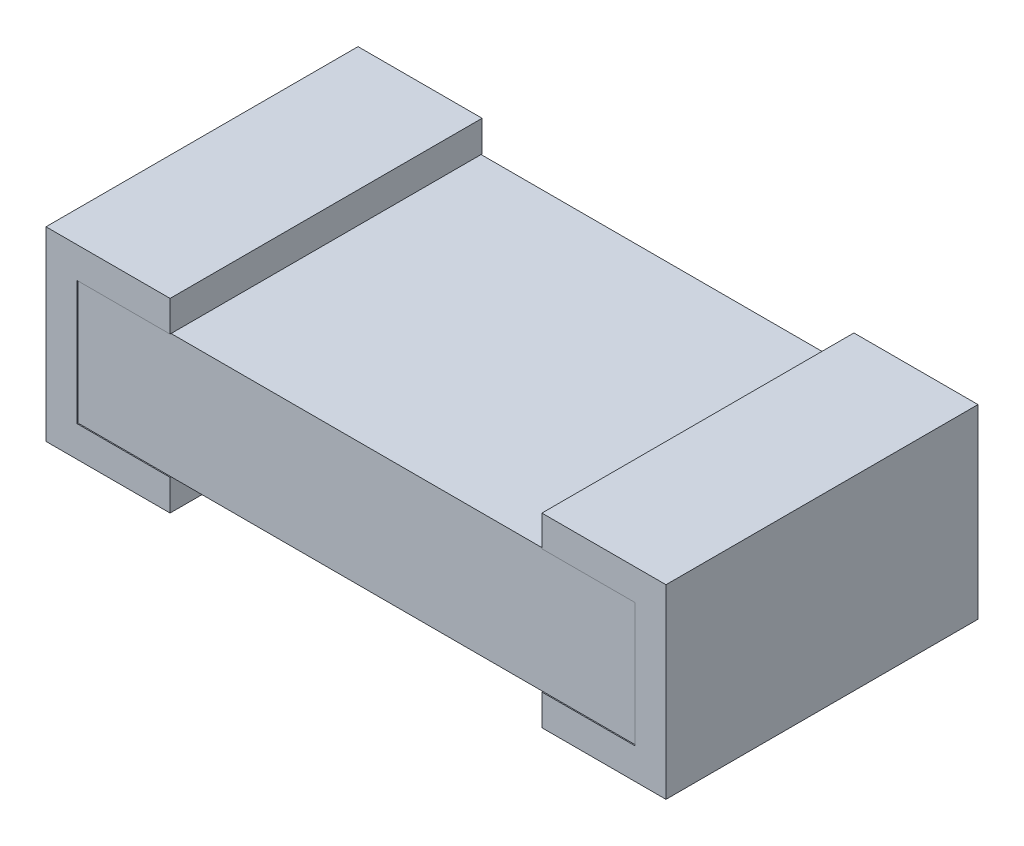
ISO-10303-21;
HEADER;
FILE_DESCRIPTION(('STEP AP214'),'2;1');
FILE_NAME('part.step','',(''),(''),'','','');
FILE_SCHEMA(('AUTOMOTIVE_DESIGN { 1 0 10303 214 1 1 1 1 }'));
ENDSEC;
DATA;
#1=APPLICATION_CONTEXT('core data for automotive mechanical design processes');
#2=APPLICATION_PROTOCOL_DEFINITION('international standard','automotive_design',2000,#1);
#3=PRODUCT_CONTEXT('',#1,'mechanical');
#4=PRODUCT('Part','Part','',(#3));
#5=PRODUCT_RELATED_PRODUCT_CATEGORY('part','',(#4));
#6=PRODUCT_DEFINITION_FORMATION('','',#4);
#7=PRODUCT_DEFINITION_CONTEXT('part definition',#1,'design');
#8=PRODUCT_DEFINITION('design','',#6,#7);
#9=PRODUCT_DEFINITION_SHAPE('','',#8);
#10=(LENGTH_UNIT() NAMED_UNIT(*) SI_UNIT(.MILLI.,.METRE.));
#11=(NAMED_UNIT(*) PLANE_ANGLE_UNIT() SI_UNIT($,.RADIAN.));
#12=(NAMED_UNIT(*) SI_UNIT($,.STERADIAN.) SOLID_ANGLE_UNIT());
#13=UNCERTAINTY_MEASURE_WITH_UNIT(LENGTH_MEASURE(1.E-05),#10,'distance_accuracy_value','');
#14=(GEOMETRIC_REPRESENTATION_CONTEXT(3) GLOBAL_UNCERTAINTY_ASSIGNED_CONTEXT((#13)) GLOBAL_UNIT_ASSIGNED_CONTEXT((#10,
#11,#12)) REPRESENTATION_CONTEXT('',''));
#15=CARTESIAN_POINT('',(0.,0.,0.));
#16=DIRECTION('',(0.,0.,1.));
#17=DIRECTION('',(1.,0.,0.));
#18=AXIS2_PLACEMENT_3D('',#15,#16,#17);
#19=CARTESIAN_POINT('',(-0.686,0.1525,0.381));
#20=DIRECTION('',(0.,-1.,0.));
#21=DIRECTION('',(0.,0.,-1.));
#22=AXIS2_PLACEMENT_3D('',#19,#20,#21);
#23=PLANE('',#22);
#24=DIRECTION('',(-1.,0.,0.));
#25=VECTOR('',#24,1.);
#26=CARTESIAN_POINT('',(-0.686,0.1525,0.381));
#27=LINE('',#26,#25);
#28=CARTESIAN_POINT('',(0.457,0.1525,0.381));
#29=VERTEX_POINT('',#28);
#30=CARTESIAN_POINT('',(-0.457,0.1525,0.381));
#31=VERTEX_POINT('',#30);
#32=EDGE_CURVE('E60',#29,#31,#27,.T.);
#33=ORIENTED_EDGE('',*,*,#32,.F.);
#34=DIRECTION('',(0.,0.,-1.));
#35=VECTOR('',#34,1.);
#36=CARTESIAN_POINT('',(0.457,0.1525,0.3835));
#37=LINE('',#36,#35);
#38=CARTESIAN_POINT('',(0.457,0.1525,-0.381));
#39=VERTEX_POINT('',#38);
#40=EDGE_CURVE('E207',#29,#39,#37,.T.);
#41=ORIENTED_EDGE('',*,*,#40,.T.);
#42=DIRECTION('',(-1.,0.,0.));
#43=VECTOR('',#42,1.);
#44=CARTESIAN_POINT('',(-0.686,0.1525,-0.381));
#45=LINE('',#44,#43);
#46=CARTESIAN_POINT('',(-0.457,0.1525,-0.381));
#47=VERTEX_POINT('',#46);
#48=EDGE_CURVE('E371',#39,#47,#45,.T.);
#49=ORIENTED_EDGE('',*,*,#48,.T.);
#50=DIRECTION('',(0.,0.,-1.));
#51=VECTOR('',#50,1.);
#52=CARTESIAN_POINT('',(-0.457,0.1525,0.3835));
#53=LINE('',#52,#51);
#54=EDGE_CURVE('E330',#31,#47,#53,.T.);
#55=ORIENTED_EDGE('',*,*,#54,.F.);
#56=EDGE_LOOP('',(#33,#41,#49,#55));
#57=FACE_BOUND('',#56,.T.);
#58=ADVANCED_FACE('F36',(#57),#23,.F.);
#59=CARTESIAN_POINT('',(-0.686,-0.1525,0.381));
#60=DIRECTION('',(0.,1.,0.));
#61=DIRECTION('',(0.,0.,1.));
#62=AXIS2_PLACEMENT_3D('',#59,#60,#61);
#63=PLANE('',#62);
#64=DIRECTION('',(1.,0.,0.));
#65=VECTOR('',#64,1.);
#66=CARTESIAN_POINT('',(-0.686,-0.1525,-0.381));
#67=LINE('',#66,#65);
#68=CARTESIAN_POINT('',(-0.457,-0.1525,-0.381));
#69=VERTEX_POINT('',#68);
#70=CARTESIAN_POINT('',(0.457,-0.1525,-0.381));
#71=VERTEX_POINT('',#70);
#72=EDGE_CURVE('E378',#69,#71,#67,.T.);
#73=ORIENTED_EDGE('',*,*,#72,.T.);
#74=DIRECTION('',(0.,0.,-1.));
#75=VECTOR('',#74,1.);
#76=CARTESIAN_POINT('',(0.457,-0.1525,0.3835));
#77=LINE('',#76,#75);
#78=CARTESIAN_POINT('',(0.457,-0.1525,0.381));
#79=VERTEX_POINT('',#78);
#80=EDGE_CURVE('E52',#79,#71,#77,.T.);
#81=ORIENTED_EDGE('',*,*,#80,.F.);
#82=DIRECTION('',(1.,0.,0.));
#83=VECTOR('',#82,1.);
#84=CARTESIAN_POINT('',(-0.686,-0.1525,0.381));
#85=LINE('',#84,#83);
#86=CARTESIAN_POINT('',(-0.457,-0.1525,0.381));
#87=VERTEX_POINT('',#86);
#88=EDGE_CURVE('E44',#87,#79,#85,.T.);
#89=ORIENTED_EDGE('',*,*,#88,.F.);
#90=DIRECTION('',(0.,0.,-1.));
#91=VECTOR('',#90,1.);
#92=CARTESIAN_POINT('',(-0.457,-0.1525,0.3835));
#93=LINE('',#92,#91);
#94=EDGE_CURVE('E343',#87,#69,#93,.T.);
#95=ORIENTED_EDGE('',*,*,#94,.T.);
#96=EDGE_LOOP('',(#73,#81,#89,#95));
#97=FACE_BOUND('',#96,.T.);
#98=ADVANCED_FACE('F394',(#97),#63,.F.);
#99=CARTESIAN_POINT('',(0.686,0.1525,0.381));
#100=DIRECTION('',(0.,0.,-1.));
#101=DIRECTION('',(-1.,0.,0.));
#102=AXIS2_PLACEMENT_3D('',#99,#100,#101);
#103=PLANE('',#102);
#104=DIRECTION('',(0.,1.,0.));
#105=VECTOR('',#104,1.);
#106=CARTESIAN_POINT('',(0.686,-0.1525,0.381));
#107=LINE('',#106,#105);
#108=CARTESIAN_POINT('',(0.686,-0.1525,0.381));
#109=VERTEX_POINT('',#108);
#110=CARTESIAN_POINT('',(0.686,0.1525,0.381));
#111=VERTEX_POINT('',#110);
#112=EDGE_CURVE('E359',#109,#111,#107,.T.);
#113=ORIENTED_EDGE('',*,*,#112,.T.);
#114=EDGE_CURVE('E361',#111,#29,#27,.T.);
#115=ORIENTED_EDGE('',*,*,#114,.T.);
#116=ORIENTED_EDGE('',*,*,#32,.T.);
#117=DIRECTION('',(1.,0.,0.));
#118=VECTOR('',#117,1.);
#119=CARTESIAN_POINT('',(0.686,0.1525,0.381));
#120=LINE('',#119,#118);
#121=CARTESIAN_POINT('',(-0.686,0.1525,0.381));
#122=VERTEX_POINT('',#121);
#123=EDGE_CURVE('E355',#122,#31,#120,.T.);
#124=ORIENTED_EDGE('',*,*,#123,.F.);
#125=DIRECTION('',(0.,-1.,0.));
#126=VECTOR('',#125,1.);
#127=CARTESIAN_POINT('',(-0.686,-0.1525,0.381));
#128=LINE('',#127,#126);
#129=CARTESIAN_POINT('',(-0.686,-0.1525,0.381));
#130=VERTEX_POINT('',#129);
#131=EDGE_CURVE('E363',#122,#130,#128,.T.);
#132=ORIENTED_EDGE('',*,*,#131,.T.);
#133=EDGE_CURVE('E11',#130,#87,#85,.T.);
#134=ORIENTED_EDGE('',*,*,#133,.T.);
#135=ORIENTED_EDGE('',*,*,#88,.T.);
#136=DIRECTION('',(1.,0.,0.));
#137=VECTOR('',#136,1.);
#138=CARTESIAN_POINT('',(0.686,-0.1525,0.381));
#139=LINE('',#138,#137);
#140=EDGE_CURVE('E211',#79,#109,#139,.T.);
#141=ORIENTED_EDGE('',*,*,#140,.T.);
#142=EDGE_LOOP('',(#113,#115,#116,#124,#132,#134,#135,#141));
#143=FACE_BOUND('',#142,.T.);
#144=ADVANCED_FACE('F421',(#143),#103,.F.);
#145=CARTESIAN_POINT('',(0.686,0.1525,-0.381));
#146=DIRECTION('',(0.,0.,-1.));
#147=DIRECTION('',(-1.,0.,0.));
#148=AXIS2_PLACEMENT_3D('',#145,#146,#147);
#149=PLANE('',#148);
#150=DIRECTION('',(0.,1.,0.));
#151=VECTOR('',#150,1.);
#152=CARTESIAN_POINT('',(0.686,-0.1525,-0.381));
#153=LINE('',#152,#151);
#154=CARTESIAN_POINT('',(0.686,-0.1525,-0.381));
#155=VERTEX_POINT('',#154);
#156=CARTESIAN_POINT('',(0.686,0.1525,-0.381));
#157=VERTEX_POINT('',#156);
#158=EDGE_CURVE('E358',#155,#157,#153,.T.);
#159=ORIENTED_EDGE('',*,*,#158,.F.);
#160=EDGE_CURVE('E373',#71,#155,#67,.T.);
#161=ORIENTED_EDGE('',*,*,#160,.F.);
#162=ORIENTED_EDGE('',*,*,#72,.F.);
#163=CARTESIAN_POINT('',(-0.686,-0.1525,-0.381));
#164=VERTEX_POINT('',#163);
#165=EDGE_CURVE('E39',#164,#69,#67,.T.);
#166=ORIENTED_EDGE('',*,*,#165,.F.);
#167=DIRECTION('',(0.,-1.,0.));
#168=VECTOR('',#167,1.);
#169=CARTESIAN_POINT('',(-0.686,-0.1525,-0.381));
#170=LINE('',#169,#168);
#171=CARTESIAN_POINT('',(-0.686,0.1525,-0.381));
#172=VERTEX_POINT('',#171);
#173=EDGE_CURVE('E370',#172,#164,#170,.T.);
#174=ORIENTED_EDGE('',*,*,#173,.F.);
#175=EDGE_CURVE('E367',#47,#172,#45,.T.);
#176=ORIENTED_EDGE('',*,*,#175,.F.);
#177=ORIENTED_EDGE('',*,*,#48,.F.);
#178=EDGE_CURVE('E368',#157,#39,#45,.T.);
#179=ORIENTED_EDGE('',*,*,#178,.F.);
#180=EDGE_LOOP('',(#159,#161,#162,#166,#174,#176,#177,#179));
#181=FACE_BOUND('',#180,.T.);
#182=ADVANCED_FACE('F395',(#181),#149,.T.);
#183=CARTESIAN_POINT('',(-0.686,-0.1525,0.3835));
#184=DIRECTION('',(0.,-1.,0.));
#185=DIRECTION('',(0.,0.,-1.));
#186=AXIS2_PLACEMENT_3D('',#183,#184,#185);
#187=PLANE('',#186);
#188=CARTESIAN_POINT('',(-0.457,-0.1525,0.3835));
#189=VERTEX_POINT('',#188);
#190=EDGE_CURVE('E339',#189,#87,#93,.T.);
#191=ORIENTED_EDGE('',*,*,#190,.T.);
#192=ORIENTED_EDGE('',*,*,#133,.F.);
#193=DIRECTION('',(0.,0.,-1.));
#194=VECTOR('',#193,1.);
#195=CARTESIAN_POINT('',(-0.686,-0.1525,0.3835));
#196=LINE('',#195,#194);
#197=CARTESIAN_POINT('',(-0.686,-0.1525,0.3835));
#198=VERTEX_POINT('',#197);
#199=EDGE_CURVE('E335',#198,#130,#196,.T.);
#200=ORIENTED_EDGE('',*,*,#199,.F.);
#201=DIRECTION('',(-1.,0.,0.));
#202=VECTOR('',#201,1.);
#203=CARTESIAN_POINT('',(-0.686,-0.1525,0.3835));
#204=LINE('',#203,#202);
#205=EDGE_CURVE('E300',#189,#198,#204,.T.);
#206=ORIENTED_EDGE('',*,*,#205,.F.);
#207=EDGE_LOOP('',(#191,#192,#200,#206));
#208=FACE_BOUND('',#207,.T.);
#209=ADVANCED_FACE('F426',(#208),#187,.F.);
#210=CARTESIAN_POINT('',(-0.686,0.1525,0.3835));
#211=DIRECTION('',(-1.,0.,0.));
#212=DIRECTION('',(0.,0.,1.));
#213=AXIS2_PLACEMENT_3D('',#210,#211,#212);
#214=PLANE('',#213);
#215=ORIENTED_EDGE('',*,*,#199,.T.);
#216=ORIENTED_EDGE('',*,*,#131,.F.);
#217=DIRECTION('',(0.,0.,-1.));
#218=VECTOR('',#217,1.);
#219=CARTESIAN_POINT('',(-0.686,0.1525,0.3835));
#220=LINE('',#219,#218);
#221=CARTESIAN_POINT('',(-0.686,0.1525,0.3835));
#222=VERTEX_POINT('',#221);
#223=EDGE_CURVE('E331',#222,#122,#220,.T.);
#224=ORIENTED_EDGE('',*,*,#223,.F.);
#225=DIRECTION('',(0.,1.,0.));
#226=VECTOR('',#225,1.);
#227=CARTESIAN_POINT('',(-0.686,0.1525,0.3835));
#228=LINE('',#227,#226);
#229=EDGE_CURVE('E302',#198,#222,#228,.T.);
#230=ORIENTED_EDGE('',*,*,#229,.F.);
#231=EDGE_LOOP('',(#215,#216,#224,#230));
#232=FACE_BOUND('',#231,.T.);
#233=ADVANCED_FACE('F430',(#232),#214,.F.);
#234=CARTESIAN_POINT('',(-0.457,0.1525,0.3835));
#235=DIRECTION('',(0.,1.,0.));
#236=DIRECTION('',(0.,0.,1.));
#237=AXIS2_PLACEMENT_3D('',#234,#235,#236);
#238=PLANE('',#237);
#239=ORIENTED_EDGE('',*,*,#223,.T.);
#240=ORIENTED_EDGE('',*,*,#123,.T.);
#241=CARTESIAN_POINT('',(-0.457,0.1525,0.3835));
#242=VERTEX_POINT('',#241);
#243=EDGE_CURVE('E326',#242,#31,#53,.T.);
#244=ORIENTED_EDGE('',*,*,#243,.F.);
#245=DIRECTION('',(1.,0.,0.));
#246=VECTOR('',#245,1.);
#247=CARTESIAN_POINT('',(-0.457,0.1525,0.3835));
#248=LINE('',#247,#246);
#249=EDGE_CURVE('E304',#222,#242,#248,.T.);
#250=ORIENTED_EDGE('',*,*,#249,.F.);
#251=EDGE_LOOP('',(#239,#240,#244,#250));
#252=FACE_BOUND('',#251,.T.);
#253=ADVANCED_FACE('F456',(#252),#238,.F.);
#254=CARTESIAN_POINT('',(-0.457,0.2285,0.3835));
#255=DIRECTION('',(-1.,0.,0.));
#256=DIRECTION('',(0.,-1.,0.));
#257=AXIS2_PLACEMENT_3D('',#254,#255,#256);
#258=PLANE('',#257);
#259=DIRECTION('',(0.,1.,0.));
#260=VECTOR('',#259,1.);
#261=CARTESIAN_POINT('',(-0.457,0.2285,-0.3835));
#262=LINE('',#261,#260);
#263=CARTESIAN_POINT('',(-0.457,0.1525,-0.3835));
#264=VERTEX_POINT('',#263);
#265=CARTESIAN_POINT('',(-0.457,0.2285,-0.3835));
#266=VERTEX_POINT('',#265);
#267=EDGE_CURVE('E287',#264,#266,#262,.T.);
#268=ORIENTED_EDGE('',*,*,#267,.T.);
#269=DIRECTION('',(0.,0.,-1.));
#270=VECTOR('',#269,1.);
#271=CARTESIAN_POINT('',(-0.457,0.2285,0.3835));
#272=LINE('',#271,#270);
#273=CARTESIAN_POINT('',(-0.457,0.2285,0.3835));
#274=VERTEX_POINT('',#273);
#275=EDGE_CURVE('E352',#274,#266,#272,.T.);
#276=ORIENTED_EDGE('',*,*,#275,.F.);
#277=DIRECTION('',(0.,1.,0.));
#278=VECTOR('',#277,1.);
#279=CARTESIAN_POINT('',(-0.457,0.2285,0.3835));
#280=LINE('',#279,#278);
#281=EDGE_CURVE('E288',#242,#274,#280,.T.);
#282=ORIENTED_EDGE('',*,*,#281,.F.);
#283=ORIENTED_EDGE('',*,*,#243,.T.);
#284=ORIENTED_EDGE('',*,*,#54,.T.);
#285=EDGE_CURVE('E306',#47,#264,#53,.T.);
#286=ORIENTED_EDGE('',*,*,#285,.T.);
#287=EDGE_LOOP('',(#268,#276,#282,#283,#284,#286));
#288=FACE_BOUND('',#287,.T.);
#289=ADVANCED_FACE('F458',(#288),#258,.F.);
#290=CARTESIAN_POINT('',(-0.762,0.2285,0.3835));
#291=DIRECTION('',(0.,-1.,0.));
#292=DIRECTION('',(0.,0.,-1.));
#293=AXIS2_PLACEMENT_3D('',#290,#291,#292);
#294=PLANE('',#293);
#295=DIRECTION('',(-1.,0.,0.));
#296=VECTOR('',#295,1.);
#297=CARTESIAN_POINT('',(-0.762,0.2285,-0.3835));
#298=LINE('',#297,#296);
#299=CARTESIAN_POINT('',(-0.762,0.2285,-0.3835));
#300=VERTEX_POINT('',#299);
#301=EDGE_CURVE('E309',#266,#300,#298,.T.);
#302=ORIENTED_EDGE('',*,*,#301,.T.);
#303=DIRECTION('',(0.,0.,-1.));
#304=VECTOR('',#303,1.);
#305=CARTESIAN_POINT('',(-0.762,0.2285,0.3835));
#306=LINE('',#305,#304);
#307=CARTESIAN_POINT('',(-0.762,0.2285,0.3835));
#308=VERTEX_POINT('',#307);
#309=EDGE_CURVE('E349',#308,#300,#306,.T.);
#310=ORIENTED_EDGE('',*,*,#309,.F.);
#311=DIRECTION('',(-1.,0.,0.));
#312=VECTOR('',#311,1.);
#313=CARTESIAN_POINT('',(-0.762,0.2285,0.3835));
#314=LINE('',#313,#312);
#315=EDGE_CURVE('E291',#274,#308,#314,.T.);
#316=ORIENTED_EDGE('',*,*,#315,.F.);
#317=ORIENTED_EDGE('',*,*,#275,.T.);
#318=EDGE_LOOP('',(#302,#310,#316,#317));
#319=FACE_BOUND('',#318,.T.);
#320=ADVANCED_FACE('F464',(#319),#294,.F.);
#321=CARTESIAN_POINT('',(-0.762,-0.2285,0.3835));
#322=DIRECTION('',(1.,0.,0.));
#323=DIRECTION('',(0.,0.,-1.));
#324=AXIS2_PLACEMENT_3D('',#321,#322,#323);
#325=PLANE('',#324);
#326=DIRECTION('',(0.,-1.,0.));
#327=VECTOR('',#326,1.);
#328=CARTESIAN_POINT('',(-0.762,-0.2285,-0.3835));
#329=LINE('',#328,#327);
#330=CARTESIAN_POINT('',(-0.762,-0.2285,-0.3835));
#331=VERTEX_POINT('',#330);
#332=EDGE_CURVE('E311',#300,#331,#329,.T.);
#333=ORIENTED_EDGE('',*,*,#332,.T.);
#334=DIRECTION('',(0.,0.,-1.));
#335=VECTOR('',#334,1.);
#336=CARTESIAN_POINT('',(-0.762,-0.2285,0.3835));
#337=LINE('',#336,#335);
#338=CARTESIAN_POINT('',(-0.762,-0.2285,0.3835));
#339=VERTEX_POINT('',#338);
#340=EDGE_CURVE('E346',#339,#331,#337,.T.);
#341=ORIENTED_EDGE('',*,*,#340,.F.);
#342=DIRECTION('',(0.,-1.,0.));
#343=VECTOR('',#342,1.);
#344=CARTESIAN_POINT('',(-0.762,-0.2285,0.3835));
#345=LINE('',#344,#343);
#346=EDGE_CURVE('E294',#308,#339,#345,.T.);
#347=ORIENTED_EDGE('',*,*,#346,.F.);
#348=ORIENTED_EDGE('',*,*,#309,.T.);
#349=EDGE_LOOP('',(#333,#341,#347,#348));
#350=FACE_BOUND('',#349,.T.);
#351=ADVANCED_FACE('F466',(#350),#325,.F.);
#352=CARTESIAN_POINT('',(-0.457,-0.2285,0.3835));
#353=DIRECTION('',(0.,1.,0.));
#354=DIRECTION('',(-1.,0.,0.));
#355=AXIS2_PLACEMENT_3D('',#352,#353,#354);
#356=PLANE('',#355);
#357=DIRECTION('',(1.,0.,0.));
#358=VECTOR('',#357,1.);
#359=CARTESIAN_POINT('',(-0.457,-0.2285,-0.3835));
#360=LINE('',#359,#358);
#361=CARTESIAN_POINT('',(-0.457,-0.2285,-0.3835));
#362=VERTEX_POINT('',#361);
#363=EDGE_CURVE('E313',#331,#362,#360,.T.);
#364=ORIENTED_EDGE('',*,*,#363,.T.);
#365=DIRECTION('',(0.,0.,-1.));
#366=VECTOR('',#365,1.);
#367=CARTESIAN_POINT('',(-0.457,-0.2285,0.3835));
#368=LINE('',#367,#366);
#369=CARTESIAN_POINT('',(-0.457,-0.2285,0.3835));
#370=VERTEX_POINT('',#369);
#371=EDGE_CURVE('E342',#370,#362,#368,.T.);
#372=ORIENTED_EDGE('',*,*,#371,.F.);
#373=DIRECTION('',(1.,0.,0.));
#374=VECTOR('',#373,1.);
#375=CARTESIAN_POINT('',(-0.457,-0.2285,0.3835));
#376=LINE('',#375,#374);
#377=EDGE_CURVE('E296',#339,#370,#376,.T.);
#378=ORIENTED_EDGE('',*,*,#377,.F.);
#379=ORIENTED_EDGE('',*,*,#340,.T.);
#380=EDGE_LOOP('',(#364,#372,#378,#379));
#381=FACE_BOUND('',#380,.T.);
#382=ADVANCED_FACE('F467',(#381),#356,.F.);
#383=CARTESIAN_POINT('',(-0.457,-0.1525,0.3835));
#384=DIRECTION('',(-1.,0.,0.));
#385=DIRECTION('',(0.,-1.,0.));
#386=AXIS2_PLACEMENT_3D('',#383,#384,#385);
#387=PLANE('',#386);
#388=DIRECTION('',(0.,1.,0.));
#389=VECTOR('',#388,1.);
#390=CARTESIAN_POINT('',(-0.457,-0.1525,-0.3835));
#391=LINE('',#390,#389);
#392=CARTESIAN_POINT('',(-0.457,-0.1525,-0.3835));
#393=VERTEX_POINT('',#392);
#394=EDGE_CURVE('E315',#362,#393,#391,.T.);
#395=ORIENTED_EDGE('',*,*,#394,.T.);
#396=EDGE_CURVE('E338',#69,#393,#93,.T.);
#397=ORIENTED_EDGE('',*,*,#396,.F.);
#398=ORIENTED_EDGE('',*,*,#94,.F.);
#399=ORIENTED_EDGE('',*,*,#190,.F.);
#400=DIRECTION('',(0.,1.,0.));
#401=VECTOR('',#400,1.);
#402=CARTESIAN_POINT('',(-0.457,-0.1525,0.3835));
#403=LINE('',#402,#401);
#404=EDGE_CURVE('E298',#370,#189,#403,.T.);
#405=ORIENTED_EDGE('',*,*,#404,.F.);
#406=ORIENTED_EDGE('',*,*,#371,.T.);
#407=EDGE_LOOP('',(#395,#397,#398,#399,#405,#406));
#408=FACE_BOUND('',#407,.T.);
#409=ADVANCED_FACE('F390',(#408),#387,.F.);
#410=ORIENTED_EDGE('',*,*,#165,.T.);
#411=ORIENTED_EDGE('',*,*,#396,.T.);
#412=DIRECTION('',(-1.,0.,0.));
#413=VECTOR('',#412,1.);
#414=CARTESIAN_POINT('',(-0.686,-0.1525,-0.3835));
#415=LINE('',#414,#413);
#416=CARTESIAN_POINT('',(-0.686,-0.1525,-0.3835));
#417=VERTEX_POINT('',#416);
#418=EDGE_CURVE('E318',#393,#417,#415,.T.);
#419=ORIENTED_EDGE('',*,*,#418,.T.);
#420=EDGE_CURVE('E334',#164,#417,#196,.T.);
#421=ORIENTED_EDGE('',*,*,#420,.F.);
#422=EDGE_LOOP('',(#410,#411,#419,#421));
#423=FACE_BOUND('',#422,.T.);
#424=ADVANCED_FACE('F385',(#423),#187,.F.);
#425=ORIENTED_EDGE('',*,*,#173,.T.);
#426=ORIENTED_EDGE('',*,*,#420,.T.);
#427=DIRECTION('',(0.,1.,0.));
#428=VECTOR('',#427,1.);
#429=CARTESIAN_POINT('',(-0.686,0.1525,-0.3835));
#430=LINE('',#429,#428);
#431=CARTESIAN_POINT('',(-0.686,0.1525,-0.3835));
#432=VERTEX_POINT('',#431);
#433=EDGE_CURVE('E321',#417,#432,#430,.T.);
#434=ORIENTED_EDGE('',*,*,#433,.T.);
#435=EDGE_CURVE('E329',#172,#432,#220,.T.);
#436=ORIENTED_EDGE('',*,*,#435,.F.);
#437=EDGE_LOOP('',(#425,#426,#434,#436));
#438=FACE_BOUND('',#437,.T.);
#439=ADVANCED_FACE('F447',(#438),#214,.F.);
#440=ORIENTED_EDGE('',*,*,#175,.T.);
#441=ORIENTED_EDGE('',*,*,#435,.T.);
#442=DIRECTION('',(1.,0.,0.));
#443=VECTOR('',#442,1.);
#444=CARTESIAN_POINT('',(-0.457,0.1525,-0.3835));
#445=LINE('',#444,#443);
#446=EDGE_CURVE('E292',#432,#264,#445,.T.);
#447=ORIENTED_EDGE('',*,*,#446,.T.);
#448=ORIENTED_EDGE('',*,*,#285,.F.);
#449=EDGE_LOOP('',(#440,#441,#447,#448));
#450=FACE_BOUND('',#449,.T.);
#451=ADVANCED_FACE('F450',(#450),#238,.F.);
#452=CARTESIAN_POINT('',(-0.457,0.1525,0.3835));
#453=DIRECTION('',(0.,0.,-1.));
#454=DIRECTION('',(-1.,0.,0.));
#455=AXIS2_PLACEMENT_3D('',#452,#453,#454);
#456=PLANE('',#455);
#457=ORIENTED_EDGE('',*,*,#281,.T.);
#458=ORIENTED_EDGE('',*,*,#315,.T.);
#459=ORIENTED_EDGE('',*,*,#346,.T.);
#460=ORIENTED_EDGE('',*,*,#377,.T.);
#461=ORIENTED_EDGE('',*,*,#404,.T.);
#462=ORIENTED_EDGE('',*,*,#205,.T.);
#463=ORIENTED_EDGE('',*,*,#229,.T.);
#464=ORIENTED_EDGE('',*,*,#249,.T.);
#465=EDGE_LOOP('',(#457,#458,#459,#460,#461,#462,#463,#464));
#466=FACE_BOUND('',#465,.T.);
#467=ADVANCED_FACE('F434',(#466),#456,.F.);
#468=CARTESIAN_POINT('',(-0.457,0.1525,-0.3835));
#469=DIRECTION('',(0.,0.,-1.));
#470=DIRECTION('',(-1.,0.,0.));
#471=AXIS2_PLACEMENT_3D('',#468,#469,#470);
#472=PLANE('',#471);
#473=ORIENTED_EDGE('',*,*,#267,.F.);
#474=ORIENTED_EDGE('',*,*,#446,.F.);
#475=ORIENTED_EDGE('',*,*,#433,.F.);
#476=ORIENTED_EDGE('',*,*,#418,.F.);
#477=ORIENTED_EDGE('',*,*,#394,.F.);
#478=ORIENTED_EDGE('',*,*,#363,.F.);
#479=ORIENTED_EDGE('',*,*,#332,.F.);
#480=ORIENTED_EDGE('',*,*,#301,.F.);
#481=EDGE_LOOP('',(#473,#474,#475,#476,#477,#478,#479,#480));
#482=FACE_BOUND('',#481,.T.);
#483=ADVANCED_FACE('F443',(#482),#472,.T.);
#484=CARTESIAN_POINT('',(0.457,0.1525,0.3835));
#485=DIRECTION('',(0.,-1.,0.));
#486=DIRECTION('',(0.,0.,-1.));
#487=AXIS2_PLACEMENT_3D('',#484,#485,#486);
#488=PLANE('',#487);
#489=ORIENTED_EDGE('',*,*,#114,.F.);
#490=DIRECTION('',(0.,0.,-1.));
#491=VECTOR('',#490,1.);
#492=CARTESIAN_POINT('',(0.686,0.1525,0.3835));
#493=LINE('',#492,#491);
#494=CARTESIAN_POINT('',(0.686,0.1525,0.3835));
#495=VERTEX_POINT('',#494);
#496=EDGE_CURVE('E227',#495,#111,#493,.T.);
#497=ORIENTED_EDGE('',*,*,#496,.F.);
#498=DIRECTION('',(-1.,0.,0.));
#499=VECTOR('',#498,1.);
#500=CARTESIAN_POINT('',(0.457,0.1525,0.3835));
#501=LINE('',#500,#499);
#502=CARTESIAN_POINT('',(0.457,0.1525,0.3835));
#503=VERTEX_POINT('',#502);
#504=EDGE_CURVE('E218',#495,#503,#501,.T.);
#505=ORIENTED_EDGE('',*,*,#504,.T.);
#506=EDGE_CURVE('E200',#503,#29,#37,.T.);
#507=ORIENTED_EDGE('',*,*,#506,.T.);
#508=EDGE_LOOP('',(#489,#497,#505,#507));
#509=FACE_BOUND('',#508,.T.);
#510=ADVANCED_FACE('F225',(#509),#488,.T.);
#511=CARTESIAN_POINT('',(0.686,0.1525,0.3835));
#512=DIRECTION('',(-1.,0.,0.));
#513=DIRECTION('',(0.,0.,1.));
#514=AXIS2_PLACEMENT_3D('',#511,#512,#513);
#515=PLANE('',#514);
#516=ORIENTED_EDGE('',*,*,#112,.F.);
#517=DIRECTION('',(0.,0.,-1.));
#518=VECTOR('',#517,1.);
#519=CARTESIAN_POINT('',(0.686,-0.1525,0.3835));
#520=LINE('',#519,#518);
#521=CARTESIAN_POINT('',(0.686,-0.1525,0.3835));
#522=VERTEX_POINT('',#521);
#523=EDGE_CURVE('E281',#522,#109,#520,.T.);
#524=ORIENTED_EDGE('',*,*,#523,.F.);
#525=DIRECTION('',(0.,1.,0.));
#526=VECTOR('',#525,1.);
#527=CARTESIAN_POINT('',(0.686,0.1525,0.3835));
#528=LINE('',#527,#526);
#529=EDGE_CURVE('E228',#522,#495,#528,.T.);
#530=ORIENTED_EDGE('',*,*,#529,.T.);
#531=ORIENTED_EDGE('',*,*,#496,.T.);
#532=EDGE_LOOP('',(#516,#524,#530,#531));
#533=FACE_BOUND('',#532,.T.);
#534=ADVANCED_FACE('F419',(#533),#515,.T.);
#535=CARTESIAN_POINT('',(0.686,-0.1525,0.3835));
#536=DIRECTION('',(0.,1.,0.));
#537=DIRECTION('',(0.,0.,1.));
#538=AXIS2_PLACEMENT_3D('',#535,#536,#537);
#539=PLANE('',#538);
#540=ORIENTED_EDGE('',*,*,#140,.F.);
#541=CARTESIAN_POINT('',(0.457,-0.1525,0.3835));
#542=VERTEX_POINT('',#541);
#543=EDGE_CURVE('E277',#542,#79,#77,.T.);
#544=ORIENTED_EDGE('',*,*,#543,.F.);
#545=DIRECTION('',(1.,0.,0.));
#546=VECTOR('',#545,1.);
#547=CARTESIAN_POINT('',(0.686,-0.1525,0.3835));
#548=LINE('',#547,#546);
#549=EDGE_CURVE('E230',#542,#522,#548,.T.);
#550=ORIENTED_EDGE('',*,*,#549,.T.);
#551=ORIENTED_EDGE('',*,*,#523,.T.);
#552=EDGE_LOOP('',(#540,#544,#550,#551));
#553=FACE_BOUND('',#552,.T.);
#554=ADVANCED_FACE('F415',(#553),#539,.T.);
#555=CARTESIAN_POINT('',(0.457,0.2285,0.3835));
#556=DIRECTION('',(-1.,0.,0.));
#557=DIRECTION('',(0.,-1.,0.));
#558=AXIS2_PLACEMENT_3D('',#555,#556,#557);
#559=PLANE('',#558);
#560=DIRECTION('',(0.,1.,0.));
#561=VECTOR('',#560,1.);
#562=CARTESIAN_POINT('',(0.457,0.2285,-0.3835));
#563=LINE('',#562,#561);
#564=CARTESIAN_POINT('',(0.457,0.1525,-0.3835));
#565=VERTEX_POINT('',#564);
#566=CARTESIAN_POINT('',(0.457,0.2285,-0.3835));
#567=VERTEX_POINT('',#566);
#568=EDGE_CURVE('E246',#565,#567,#563,.T.);
#569=ORIENTED_EDGE('',*,*,#568,.F.);
#570=EDGE_CURVE('E213',#39,#565,#37,.T.);
#571=ORIENTED_EDGE('',*,*,#570,.F.);
#572=ORIENTED_EDGE('',*,*,#40,.F.);
#573=ORIENTED_EDGE('',*,*,#506,.F.);
#574=DIRECTION('',(0.,1.,0.));
#575=VECTOR('',#574,1.);
#576=CARTESIAN_POINT('',(0.457,0.2285,0.3835));
#577=LINE('',#576,#575);
#578=CARTESIAN_POINT('',(0.457,0.2285,0.3835));
#579=VERTEX_POINT('',#578);
#580=EDGE_CURVE('E204',#503,#579,#577,.T.);
#581=ORIENTED_EDGE('',*,*,#580,.T.);
#582=DIRECTION('',(0.,0.,-1.));
#583=VECTOR('',#582,1.);
#584=CARTESIAN_POINT('',(0.457,0.2285,0.3835));
#585=LINE('',#584,#583);
#586=EDGE_CURVE('E245',#579,#567,#585,.T.);
#587=ORIENTED_EDGE('',*,*,#586,.T.);
#588=EDGE_LOOP('',(#569,#571,#572,#573,#581,#587));
#589=FACE_BOUND('',#588,.T.);
#590=ADVANCED_FACE('F203',(#589),#559,.T.);
#591=CARTESIAN_POINT('',(0.686,0.1525,-0.3835));
#592=VERTEX_POINT('',#591);
#593=EDGE_CURVE('E284',#157,#592,#493,.T.);
#594=ORIENTED_EDGE('',*,*,#593,.F.);
#595=ORIENTED_EDGE('',*,*,#178,.T.);
#596=ORIENTED_EDGE('',*,*,#570,.T.);
#597=DIRECTION('',(-1.,0.,0.));
#598=VECTOR('',#597,1.);
#599=CARTESIAN_POINT('',(0.457,0.1525,-0.3835));
#600=LINE('',#599,#598);
#601=EDGE_CURVE('E249',#592,#565,#600,.T.);
#602=ORIENTED_EDGE('',*,*,#601,.F.);
#603=EDGE_LOOP('',(#594,#595,#596,#602));
#604=FACE_BOUND('',#603,.T.);
#605=ADVANCED_FACE('F403',(#604),#488,.T.);
#606=CARTESIAN_POINT('',(0.686,-0.1525,-0.3835));
#607=VERTEX_POINT('',#606);
#608=EDGE_CURVE('E280',#155,#607,#520,.T.);
#609=ORIENTED_EDGE('',*,*,#608,.F.);
#610=ORIENTED_EDGE('',*,*,#158,.T.);
#611=ORIENTED_EDGE('',*,*,#593,.T.);
#612=DIRECTION('',(0.,1.,0.));
#613=VECTOR('',#612,1.);
#614=CARTESIAN_POINT('',(0.686,0.1525,-0.3835));
#615=LINE('',#614,#613);
#616=EDGE_CURVE('E252',#607,#592,#615,.T.);
#617=ORIENTED_EDGE('',*,*,#616,.F.);
#618=EDGE_LOOP('',(#609,#610,#611,#617));
#619=FACE_BOUND('',#618,.T.);
#620=ADVANCED_FACE('F399',(#619),#515,.T.);
#621=CARTESIAN_POINT('',(0.457,-0.1525,-0.3835));
#622=VERTEX_POINT('',#621);
#623=EDGE_CURVE('E276',#71,#622,#77,.T.);
#624=ORIENTED_EDGE('',*,*,#623,.F.);
#625=ORIENTED_EDGE('',*,*,#160,.T.);
#626=ORIENTED_EDGE('',*,*,#608,.T.);
#627=DIRECTION('',(1.,0.,0.));
#628=VECTOR('',#627,1.);
#629=CARTESIAN_POINT('',(0.686,-0.1525,-0.3835));
#630=LINE('',#629,#628);
#631=EDGE_CURVE('E255',#622,#607,#630,.T.);
#632=ORIENTED_EDGE('',*,*,#631,.F.);
#633=EDGE_LOOP('',(#624,#625,#626,#632));
#634=FACE_BOUND('',#633,.T.);
#635=ADVANCED_FACE('F408',(#634),#539,.T.);
#636=CARTESIAN_POINT('',(0.457,-0.1525,0.3835));
#637=DIRECTION('',(-1.,0.,0.));
#638=DIRECTION('',(0.,-1.,0.));
#639=AXIS2_PLACEMENT_3D('',#636,#637,#638);
#640=PLANE('',#639);
#641=DIRECTION('',(0.,1.,0.));
#642=VECTOR('',#641,1.);
#643=CARTESIAN_POINT('',(0.457,-0.1525,-0.3835));
#644=LINE('',#643,#642);
#645=CARTESIAN_POINT('',(0.457,-0.2285,-0.3835));
#646=VERTEX_POINT('',#645);
#647=EDGE_CURVE('E258',#646,#622,#644,.T.);
#648=ORIENTED_EDGE('',*,*,#647,.F.);
#649=DIRECTION('',(0.,0.,-1.));
#650=VECTOR('',#649,1.);
#651=CARTESIAN_POINT('',(0.457,-0.2285,0.3835));
#652=LINE('',#651,#650);
#653=CARTESIAN_POINT('',(0.457,-0.2285,0.3835));
#654=VERTEX_POINT('',#653);
#655=EDGE_CURVE('E274',#654,#646,#652,.T.);
#656=ORIENTED_EDGE('',*,*,#655,.F.);
#657=DIRECTION('',(0.,1.,0.));
#658=VECTOR('',#657,1.);
#659=CARTESIAN_POINT('',(0.457,-0.1525,0.3835));
#660=LINE('',#659,#658);
#661=EDGE_CURVE('E235',#654,#542,#660,.T.);
#662=ORIENTED_EDGE('',*,*,#661,.T.);
#663=ORIENTED_EDGE('',*,*,#543,.T.);
#664=ORIENTED_EDGE('',*,*,#80,.T.);
#665=ORIENTED_EDGE('',*,*,#623,.T.);
#666=EDGE_LOOP('',(#648,#656,#662,#663,#664,#665));
#667=FACE_BOUND('',#666,.T.);
#668=ADVANCED_FACE('F410',(#667),#640,.T.);
#669=CARTESIAN_POINT('',(0.457,-0.2285,0.3835));
#670=DIRECTION('',(0.,-1.,0.));
#671=DIRECTION('',(1.,0.,0.));
#672=AXIS2_PLACEMENT_3D('',#669,#670,#671);
#673=PLANE('',#672);
#674=DIRECTION('',(-1.,0.,0.));
#675=VECTOR('',#674,1.);
#676=CARTESIAN_POINT('',(0.457,-0.2285,-0.3835));
#677=LINE('',#676,#675);
#678=CARTESIAN_POINT('',(0.762,-0.2285,-0.3835));
#679=VERTEX_POINT('',#678);
#680=EDGE_CURVE('E261',#679,#646,#677,.T.);
#681=ORIENTED_EDGE('',*,*,#680,.F.);
#682=DIRECTION('',(0.,0.,-1.));
#683=VECTOR('',#682,1.);
#684=CARTESIAN_POINT('',(0.762,-0.2285,0.3835));
#685=LINE('',#684,#683);
#686=CARTESIAN_POINT('',(0.762,-0.2285,0.3835));
#687=VERTEX_POINT('',#686);
#688=EDGE_CURVE('E272',#687,#679,#685,.T.);
#689=ORIENTED_EDGE('',*,*,#688,.F.);
#690=DIRECTION('',(-1.,0.,0.));
#691=VECTOR('',#690,1.);
#692=CARTESIAN_POINT('',(0.457,-0.2285,0.3835));
#693=LINE('',#692,#691);
#694=EDGE_CURVE('E238',#687,#654,#693,.T.);
#695=ORIENTED_EDGE('',*,*,#694,.T.);
#696=ORIENTED_EDGE('',*,*,#655,.T.);
#697=EDGE_LOOP('',(#681,#689,#695,#696));
#698=FACE_BOUND('',#697,.T.);
#699=ADVANCED_FACE('F643',(#698),#673,.T.);
#700=CARTESIAN_POINT('',(0.762,-0.2285,0.3835));
#701=DIRECTION('',(1.,0.,0.));
#702=DIRECTION('',(0.,0.,-1.));
#703=AXIS2_PLACEMENT_3D('',#700,#701,#702);
#704=PLANE('',#703);
#705=DIRECTION('',(0.,-1.,0.));
#706=VECTOR('',#705,1.);
#707=CARTESIAN_POINT('',(0.762,-0.2285,-0.3835));
#708=LINE('',#707,#706);
#709=CARTESIAN_POINT('',(0.762,0.2285,-0.3835));
#710=VERTEX_POINT('',#709);
#711=EDGE_CURVE('E264',#710,#679,#708,.T.);
#712=ORIENTED_EDGE('',*,*,#711,.F.);
#713=DIRECTION('',(0.,0.,-1.));
#714=VECTOR('',#713,1.);
#715=CARTESIAN_POINT('',(0.762,0.2285,0.3835));
#716=LINE('',#715,#714);
#717=CARTESIAN_POINT('',(0.762,0.2285,0.3835));
#718=VERTEX_POINT('',#717);
#719=EDGE_CURVE('E270',#718,#710,#716,.T.);
#720=ORIENTED_EDGE('',*,*,#719,.F.);
#721=DIRECTION('',(0.,-1.,0.));
#722=VECTOR('',#721,1.);
#723=CARTESIAN_POINT('',(0.762,-0.2285,0.3835));
#724=LINE('',#723,#722);
#725=EDGE_CURVE('E241',#718,#687,#724,.T.);
#726=ORIENTED_EDGE('',*,*,#725,.T.);
#727=ORIENTED_EDGE('',*,*,#688,.T.);
#728=EDGE_LOOP('',(#712,#720,#726,#727));
#729=FACE_BOUND('',#728,.T.);
#730=ADVANCED_FACE('F653',(#729),#704,.T.);
#731=CARTESIAN_POINT('',(0.762,0.2285,0.3835));
#732=DIRECTION('',(0.,1.,0.));
#733=DIRECTION('',(0.,0.,1.));
#734=AXIS2_PLACEMENT_3D('',#731,#732,#733);
#735=PLANE('',#734);
#736=DIRECTION('',(1.,0.,0.));
#737=VECTOR('',#736,1.);
#738=CARTESIAN_POINT('',(0.762,0.2285,-0.3835));
#739=LINE('',#738,#737);
#740=EDGE_CURVE('E223',#567,#710,#739,.T.);
#741=ORIENTED_EDGE('',*,*,#740,.F.);
#742=ORIENTED_EDGE('',*,*,#586,.F.);
#743=DIRECTION('',(1.,0.,0.));
#744=VECTOR('',#743,1.);
#745=CARTESIAN_POINT('',(0.762,0.2285,0.3835));
#746=LINE('',#745,#744);
#747=EDGE_CURVE('E222',#579,#718,#746,.T.);
#748=ORIENTED_EDGE('',*,*,#747,.T.);
#749=ORIENTED_EDGE('',*,*,#719,.T.);
#750=EDGE_LOOP('',(#741,#742,#748,#749));
#751=FACE_BOUND('',#750,.T.);
#752=ADVANCED_FACE('F664',(#751),#735,.T.);
#753=CARTESIAN_POINT('',(0.457,0.1525,0.3835));
#754=DIRECTION('',(0.,0.,-1.));
#755=DIRECTION('',(1.,0.,0.));
#756=AXIS2_PLACEMENT_3D('',#753,#754,#755);
#757=PLANE('',#756);
#758=ORIENTED_EDGE('',*,*,#580,.F.);
#759=ORIENTED_EDGE('',*,*,#504,.F.);
#760=ORIENTED_EDGE('',*,*,#529,.F.);
#761=ORIENTED_EDGE('',*,*,#549,.F.);
#762=ORIENTED_EDGE('',*,*,#661,.F.);
#763=ORIENTED_EDGE('',*,*,#694,.F.);
#764=ORIENTED_EDGE('',*,*,#725,.F.);
#765=ORIENTED_EDGE('',*,*,#747,.F.);
#766=EDGE_LOOP('',(#758,#759,#760,#761,#762,#763,#764,#765));
#767=FACE_BOUND('',#766,.T.);
#768=ADVANCED_FACE('F216',(#767),#757,.F.);
#769=CARTESIAN_POINT('',(0.457,0.1525,-0.3835));
#770=DIRECTION('',(0.,0.,-1.));
#771=DIRECTION('',(1.,0.,0.));
#772=AXIS2_PLACEMENT_3D('',#769,#770,#771);
#773=PLANE('',#772);
#774=ORIENTED_EDGE('',*,*,#568,.T.);
#775=ORIENTED_EDGE('',*,*,#740,.T.);
#776=ORIENTED_EDGE('',*,*,#711,.T.);
#777=ORIENTED_EDGE('',*,*,#680,.T.);
#778=ORIENTED_EDGE('',*,*,#647,.T.);
#779=ORIENTED_EDGE('',*,*,#631,.T.);
#780=ORIENTED_EDGE('',*,*,#616,.T.);
#781=ORIENTED_EDGE('',*,*,#601,.T.);
#782=EDGE_LOOP('',(#774,#775,#776,#777,#778,#779,#780,#781));
#783=FACE_BOUND('',#782,.T.);
#784=ADVANCED_FACE('F405',(#783),#773,.T.);
#785=CLOSED_SHELL('',(#58,#98,#144,#182,#209,#233,#253,#289,#320,#351,#382,#409,#424,#439,#451,
#467,#483,#510,#534,#554,#590,#605,#620,#635,#668,#699,#730,#752,#768,#784));
#786=MANIFOLD_SOLID_BREP('B2',#785);
#787=ADVANCED_BREP_SHAPE_REPRESENTATION('',(#18,#786),#14);
#788=SHAPE_DEFINITION_REPRESENTATION(#9,#787);
ENDSEC;
END-ISO-10303-21;
